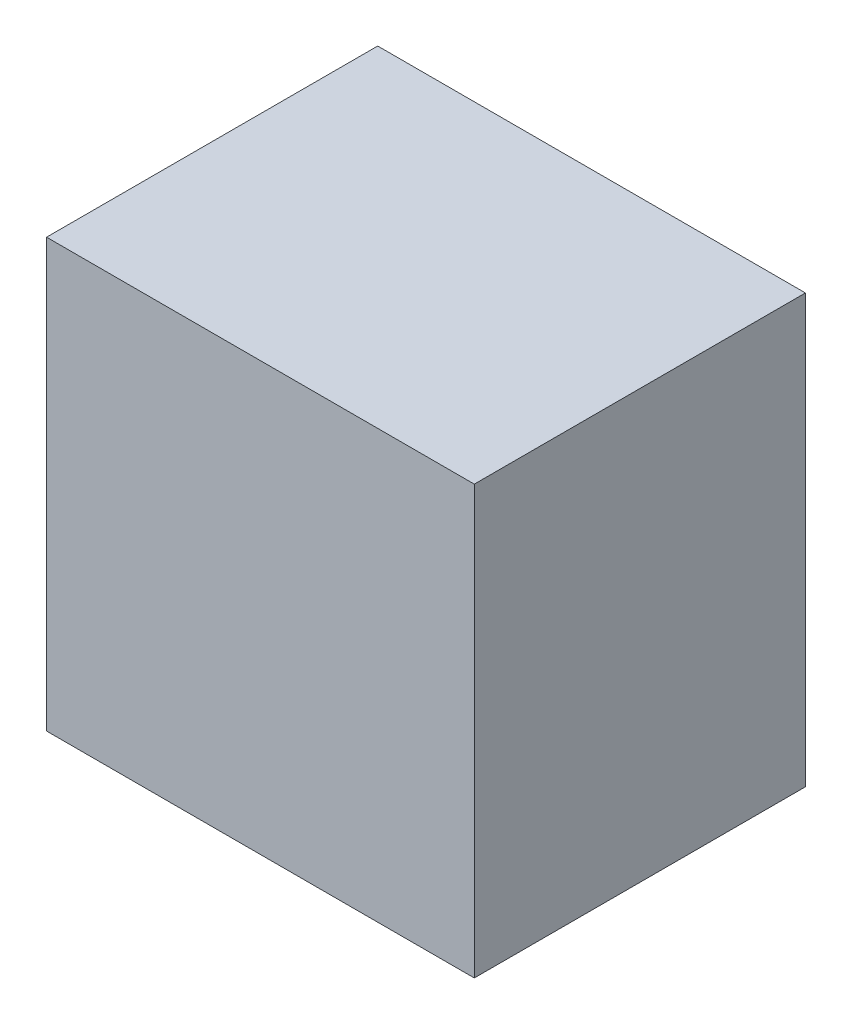
ISO-10303-21;
HEADER;
FILE_DESCRIPTION(('STEP AP214'),'2;1');
FILE_NAME('part.step','',(''),(''),'','','');
FILE_SCHEMA(('AUTOMOTIVE_DESIGN { 1 0 10303 214 1 1 1 1 }'));
ENDSEC;
DATA;
#1=APPLICATION_CONTEXT('core data for automotive mechanical design processes');
#2=APPLICATION_PROTOCOL_DEFINITION('international standard','automotive_design',2000,#1);
#3=PRODUCT_CONTEXT('',#1,'mechanical');
#4=PRODUCT('Part','Part','',(#3));
#5=PRODUCT_RELATED_PRODUCT_CATEGORY('part','',(#4));
#6=PRODUCT_DEFINITION_FORMATION('','',#4);
#7=PRODUCT_DEFINITION_CONTEXT('part definition',#1,'design');
#8=PRODUCT_DEFINITION('design','',#6,#7);
#9=PRODUCT_DEFINITION_SHAPE('','',#8);
#10=(LENGTH_UNIT() NAMED_UNIT(*) SI_UNIT(.MILLI.,.METRE.));
#11=(NAMED_UNIT(*) PLANE_ANGLE_UNIT() SI_UNIT($,.RADIAN.));
#12=(NAMED_UNIT(*) SI_UNIT($,.STERADIAN.) SOLID_ANGLE_UNIT());
#13=UNCERTAINTY_MEASURE_WITH_UNIT(LENGTH_MEASURE(1.E-05),#10,'distance_accuracy_value','');
#14=(GEOMETRIC_REPRESENTATION_CONTEXT(3) GLOBAL_UNCERTAINTY_ASSIGNED_CONTEXT((#13)) GLOBAL_UNIT_ASSIGNED_CONTEXT((#10,
#11,#12)) REPRESENTATION_CONTEXT('',''));
#15=CARTESIAN_POINT('',(0.,0.,0.));
#16=DIRECTION('',(0.,0.,1.));
#17=DIRECTION('',(1.,0.,0.));
#18=AXIS2_PLACEMENT_3D('',#15,#16,#17);
#19=CARTESIAN_POINT('',(-3.09999888,3.10000142,4.80000056));
#20=DIRECTION('',(0.,0.,1.));
#21=DIRECTION('',(1.,0.,0.));
#22=AXIS2_PLACEMENT_3D('',#19,#20,#21);
#23=PLANE('',#22);
#24=DIRECTION('',(0.,1.,0.));
#25=VECTOR('',#24,1.);
#26=CARTESIAN_POINT('',(3.10000142,3.10000142,4.80000056));
#27=LINE('',#26,#25);
#28=CARTESIAN_POINT('',(3.10000142,3.10000142,4.80000056));
#29=VERTEX_POINT('',#28);
#30=CARTESIAN_POINT('',(3.10000142,-3.09999888,4.80000056));
#31=VERTEX_POINT('',#30);
#32=EDGE_CURVE('E52',#29,#31,#27,.F.);
#33=ORIENTED_EDGE('',*,*,#32,.F.);
#34=DIRECTION('',(1.,0.,0.));
#35=VECTOR('',#34,1.);
#36=CARTESIAN_POINT('',(-3.09999888,3.10000142,4.80000056));
#37=LINE('',#36,#35);
#38=CARTESIAN_POINT('',(-3.09999888,3.10000142,4.80000056));
#39=VERTEX_POINT('',#38);
#40=EDGE_CURVE('E67',#39,#29,#37,.T.);
#41=ORIENTED_EDGE('',*,*,#40,.F.);
#42=DIRECTION('',(0.,1.,0.));
#43=VECTOR('',#42,1.);
#44=CARTESIAN_POINT('',(-3.09999888,-3.09999888,4.80000056));
#45=LINE('',#44,#43);
#46=CARTESIAN_POINT('',(-3.09999888,-3.09999888,4.80000056));
#47=VERTEX_POINT('',#46);
#48=EDGE_CURVE('E19',#47,#39,#45,.T.);
#49=ORIENTED_EDGE('',*,*,#48,.F.);
#50=DIRECTION('',(1.,0.,0.));
#51=VECTOR('',#50,1.);
#52=CARTESIAN_POINT('',(3.10000142,-3.09999888,4.80000056));
#53=LINE('',#52,#51);
#54=EDGE_CURVE('E57',#31,#47,#53,.F.);
#55=ORIENTED_EDGE('',*,*,#54,.F.);
#56=EDGE_LOOP('',(#33,#41,#49,#55));
#57=FACE_BOUND('',#56,.T.);
#58=ADVANCED_FACE('F16',(#57),#23,.T.);
#59=CARTESIAN_POINT('',(-3.09999888,-3.09999888,0.));
#60=DIRECTION('',(-1.,0.,0.));
#61=DIRECTION('',(0.,0.,1.));
#62=AXIS2_PLACEMENT_3D('',#59,#60,#61);
#63=PLANE('',#62);
#64=DIRECTION('',(0.,0.,1.));
#65=VECTOR('',#64,1.);
#66=CARTESIAN_POINT('',(-3.09999888,3.10000142,0.));
#67=LINE('',#66,#65);
#68=CARTESIAN_POINT('',(-3.09999888,3.10000142,0.));
#69=VERTEX_POINT('',#68);
#70=EDGE_CURVE('E78',#69,#39,#67,.T.);
#71=ORIENTED_EDGE('',*,*,#70,.F.);
#72=DIRECTION('',(0.,1.,0.));
#73=VECTOR('',#72,1.);
#74=CARTESIAN_POINT('',(-3.09999888,3.10000142,0.));
#75=LINE('',#74,#73);
#76=CARTESIAN_POINT('',(-3.09999888,-3.09999888,0.));
#77=VERTEX_POINT('',#76);
#78=EDGE_CURVE('E73',#69,#77,#75,.F.);
#79=ORIENTED_EDGE('',*,*,#78,.T.);
#80=DIRECTION('',(0.,0.,-1.));
#81=VECTOR('',#80,1.);
#82=CARTESIAN_POINT('',(-3.09999888,-3.09999888,0.));
#83=LINE('',#82,#81);
#84=EDGE_CURVE('E62',#47,#77,#83,.T.);
#85=ORIENTED_EDGE('',*,*,#84,.F.);
#86=ORIENTED_EDGE('',*,*,#48,.T.);
#87=EDGE_LOOP('',(#71,#79,#85,#86));
#88=FACE_BOUND('',#87,.T.);
#89=ADVANCED_FACE('F72',(#88),#63,.T.);
#90=CARTESIAN_POINT('',(3.10000142,-3.09999888,0.));
#91=DIRECTION('',(0.,-1.,0.));
#92=DIRECTION('',(0.,0.,-1.));
#93=AXIS2_PLACEMENT_3D('',#90,#91,#92);
#94=PLANE('',#93);
#95=ORIENTED_EDGE('',*,*,#84,.T.);
#96=DIRECTION('',(1.,0.,0.));
#97=VECTOR('',#96,1.);
#98=CARTESIAN_POINT('',(-3.09999888,-3.09999888,0.));
#99=LINE('',#98,#97);
#100=CARTESIAN_POINT('',(3.10000142,-3.09999888,0.));
#101=VERTEX_POINT('',#100);
#102=EDGE_CURVE('E83',#77,#101,#99,.T.);
#103=ORIENTED_EDGE('',*,*,#102,.T.);
#104=DIRECTION('',(0.,0.,-1.));
#105=VECTOR('',#104,1.);
#106=CARTESIAN_POINT('',(3.10000142,-3.09999888,0.));
#107=LINE('',#106,#105);
#108=EDGE_CURVE('E64',#31,#101,#107,.T.);
#109=ORIENTED_EDGE('',*,*,#108,.F.);
#110=ORIENTED_EDGE('',*,*,#54,.T.);
#111=EDGE_LOOP('',(#95,#103,#109,#110));
#112=FACE_BOUND('',#111,.T.);
#113=ADVANCED_FACE('F59',(#112),#94,.T.);
#114=CARTESIAN_POINT('',(3.10000142,3.10000142,0.));
#115=DIRECTION('',(1.,0.,0.));
#116=DIRECTION('',(0.,0.,-1.));
#117=AXIS2_PLACEMENT_3D('',#114,#115,#116);
#118=PLANE('',#117);
#119=ORIENTED_EDGE('',*,*,#108,.T.);
#120=DIRECTION('',(0.,1.,0.));
#121=VECTOR('',#120,1.);
#122=CARTESIAN_POINT('',(3.10000142,3.10000142,0.));
#123=LINE('',#122,#121);
#124=CARTESIAN_POINT('',(3.10000142,3.10000142,0.));
#125=VERTEX_POINT('',#124);
#126=EDGE_CURVE('E25',#101,#125,#123,.T.);
#127=ORIENTED_EDGE('',*,*,#126,.T.);
#128=DIRECTION('',(0.,0.,1.));
#129=VECTOR('',#128,1.);
#130=CARTESIAN_POINT('',(3.10000142,3.10000142,0.));
#131=LINE('',#130,#129);
#132=EDGE_CURVE('E33',#29,#125,#131,.F.);
#133=ORIENTED_EDGE('',*,*,#132,.F.);
#134=ORIENTED_EDGE('',*,*,#32,.T.);
#135=EDGE_LOOP('',(#119,#127,#133,#134));
#136=FACE_BOUND('',#135,.T.);
#137=ADVANCED_FACE('F87',(#136),#118,.T.);
#138=CARTESIAN_POINT('',(-3.09999888,3.10000142,0.));
#139=DIRECTION('',(0.,1.,0.));
#140=DIRECTION('',(0.,0.,1.));
#141=AXIS2_PLACEMENT_3D('',#138,#139,#140);
#142=PLANE('',#141);
#143=ORIENTED_EDGE('',*,*,#132,.T.);
#144=DIRECTION('',(1.,0.,0.));
#145=VECTOR('',#144,1.);
#146=CARTESIAN_POINT('',(-3.09999888,3.10000142,0.));
#147=LINE('',#146,#145);
#148=EDGE_CURVE('E11',#125,#69,#147,.F.);
#149=ORIENTED_EDGE('',*,*,#148,.T.);
#150=ORIENTED_EDGE('',*,*,#70,.T.);
#151=ORIENTED_EDGE('',*,*,#40,.T.);
#152=EDGE_LOOP('',(#143,#149,#150,#151));
#153=FACE_BOUND('',#152,.T.);
#154=ADVANCED_FACE('F90',(#153),#142,.T.);
#155=CARTESIAN_POINT('',(-3.09999888,3.10000142,0.));
#156=DIRECTION('',(0.,0.,1.));
#157=DIRECTION('',(1.,0.,0.));
#158=AXIS2_PLACEMENT_3D('',#155,#156,#157);
#159=PLANE('',#158);
#160=ORIENTED_EDGE('',*,*,#126,.F.);
#161=ORIENTED_EDGE('',*,*,#102,.F.);
#162=ORIENTED_EDGE('',*,*,#78,.F.);
#163=ORIENTED_EDGE('',*,*,#148,.F.);
#164=EDGE_LOOP('',(#160,#161,#162,#163));
#165=FACE_BOUND('',#164,.T.);
#166=ADVANCED_FACE('F89',(#165),#159,.F.);
#167=CLOSED_SHELL('',(#58,#89,#113,#137,#154,#166));
#168=MANIFOLD_SOLID_BREP('B1',#167);
#169=ADVANCED_BREP_SHAPE_REPRESENTATION('',(#18,#168),#14);
#170=SHAPE_DEFINITION_REPRESENTATION(#9,#169);
ENDSEC;
END-ISO-10303-21;
